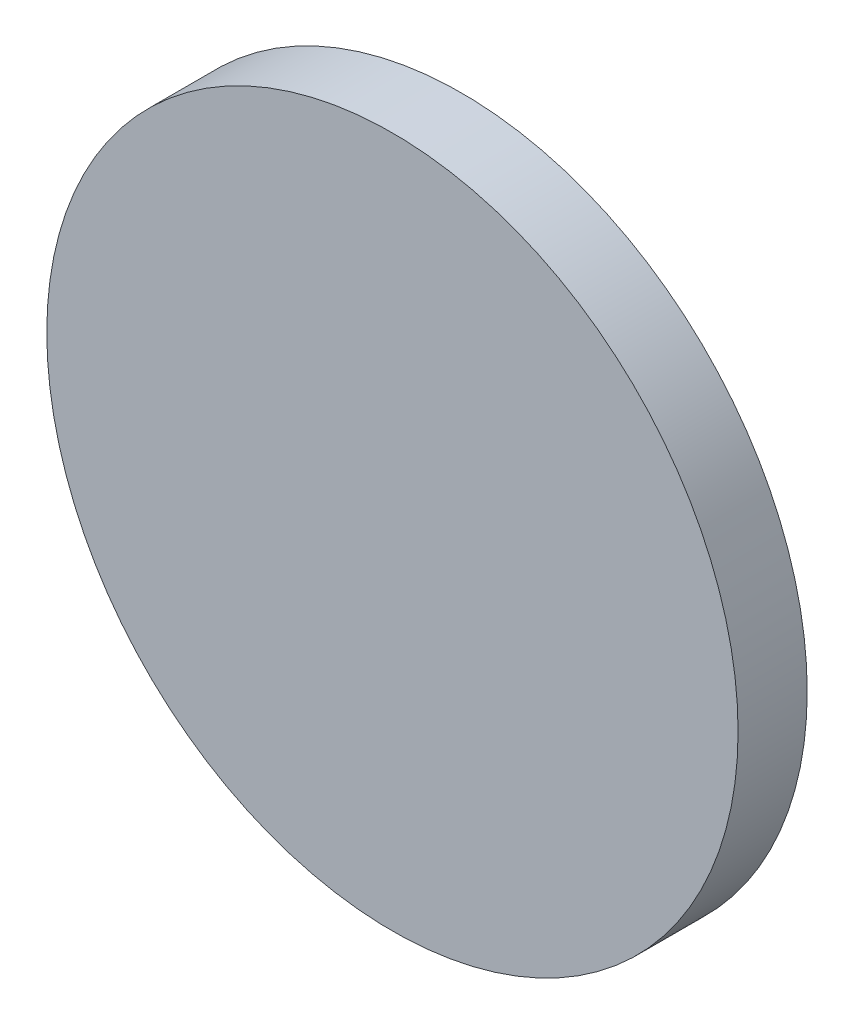
ISO-10303-21;
HEADER;
FILE_DESCRIPTION(('STEP AP214'),'2;1');
FILE_NAME('part.step','',(''),(''),'','','');
FILE_SCHEMA(('AUTOMOTIVE_DESIGN { 1 0 10303 214 1 1 1 1 }'));
ENDSEC;
DATA;
#1=APPLICATION_CONTEXT('core data for automotive mechanical design processes');
#2=APPLICATION_PROTOCOL_DEFINITION('international standard','automotive_design',2000,#1);
#3=PRODUCT_CONTEXT('',#1,'mechanical');
#4=PRODUCT('Part','Part','',(#3));
#5=PRODUCT_RELATED_PRODUCT_CATEGORY('part','',(#4));
#6=PRODUCT_DEFINITION_FORMATION('','',#4);
#7=PRODUCT_DEFINITION_CONTEXT('part definition',#1,'design');
#8=PRODUCT_DEFINITION('design','',#6,#7);
#9=PRODUCT_DEFINITION_SHAPE('','',#8);
#10=(LENGTH_UNIT() NAMED_UNIT(*) SI_UNIT(.MILLI.,.METRE.));
#11=(NAMED_UNIT(*) PLANE_ANGLE_UNIT() SI_UNIT($,.RADIAN.));
#12=(NAMED_UNIT(*) SI_UNIT($,.STERADIAN.) SOLID_ANGLE_UNIT());
#13=UNCERTAINTY_MEASURE_WITH_UNIT(LENGTH_MEASURE(1.E-05),#10,'distance_accuracy_value','');
#14=(GEOMETRIC_REPRESENTATION_CONTEXT(3) GLOBAL_UNCERTAINTY_ASSIGNED_CONTEXT((#13)) GLOBAL_UNIT_ASSIGNED_CONTEXT((#10,
#11,#12)) REPRESENTATION_CONTEXT('',''));
#15=CARTESIAN_POINT('',(0.,0.,0.));
#16=DIRECTION('',(0.,0.,1.));
#17=DIRECTION('',(1.,0.,0.));
#18=AXIS2_PLACEMENT_3D('',#15,#16,#17);
#19=CARTESIAN_POINT('',(0.,0.,6.35));
#20=DIRECTION('',(0.,0.,-1.));
#21=DIRECTION('',(-1.,0.,0.));
#22=AXIS2_PLACEMENT_3D('',#19,#20,#21);
#23=CYLINDRICAL_SURFACE('',#22,31.75);
#24=CARTESIAN_POINT('',(0.,0.,6.35));
#25=DIRECTION('',(0.,0.,1.));
#26=DIRECTION('',(1.,0.,0.));
#27=AXIS2_PLACEMENT_3D('',#24,#25,#26);
#28=CIRCLE('',#27,31.75);
#29=CARTESIAN_POINT('',(31.75,0.,6.35));
#30=VERTEX_POINT('',#29);
#31=EDGE_CURVE('E10',#30,#30,#28,.T.);
#32=ORIENTED_EDGE('',*,*,#31,.F.);
#33=EDGE_LOOP('',(#32));
#34=FACE_BOUND('',#33,.T.);
#35=CARTESIAN_POINT('',(0.,0.,0.));
#36=DIRECTION('',(0.,0.,1.));
#37=DIRECTION('',(1.,0.,0.));
#38=AXIS2_PLACEMENT_3D('',#35,#36,#37);
#39=CIRCLE('',#38,31.75);
#40=CARTESIAN_POINT('',(31.75,0.,0.));
#41=VERTEX_POINT('',#40);
#42=EDGE_CURVE('E35',#41,#41,#39,.T.);
#43=ORIENTED_EDGE('',*,*,#42,.T.);
#44=EDGE_LOOP('',(#43));
#45=FACE_BOUND('',#44,.T.);
#46=ADVANCED_FACE('F32',(#34,#45),#23,.T.);
#47=CARTESIAN_POINT('',(0.,0.,6.35));
#48=DIRECTION('',(0.,0.,1.));
#49=DIRECTION('',(1.,0.,0.));
#50=AXIS2_PLACEMENT_3D('',#47,#48,#49);
#51=PLANE('',#50);
#52=ORIENTED_EDGE('',*,*,#31,.T.);
#53=EDGE_LOOP('',(#52));
#54=FACE_BOUND('',#53,.T.);
#55=ADVANCED_FACE('F47',(#54),#51,.T.);
#56=CARTESIAN_POINT('',(0.,0.,0.));
#57=DIRECTION('',(0.,0.,1.));
#58=DIRECTION('',(1.,0.,0.));
#59=AXIS2_PLACEMENT_3D('',#56,#57,#58);
#60=PLANE('',#59);
#61=ORIENTED_EDGE('',*,*,#42,.F.);
#62=EDGE_LOOP('',(#61));
#63=FACE_BOUND('',#62,.T.);
#64=ADVANCED_FACE('F45',(#63),#60,.F.);
#65=CLOSED_SHELL('',(#46,#55,#64));
#66=MANIFOLD_SOLID_BREP('B2',#65);
#67=ADVANCED_BREP_SHAPE_REPRESENTATION('',(#18,#66),#14);
#68=SHAPE_DEFINITION_REPRESENTATION(#9,#67);
ENDSEC;
END-ISO-10303-21;
